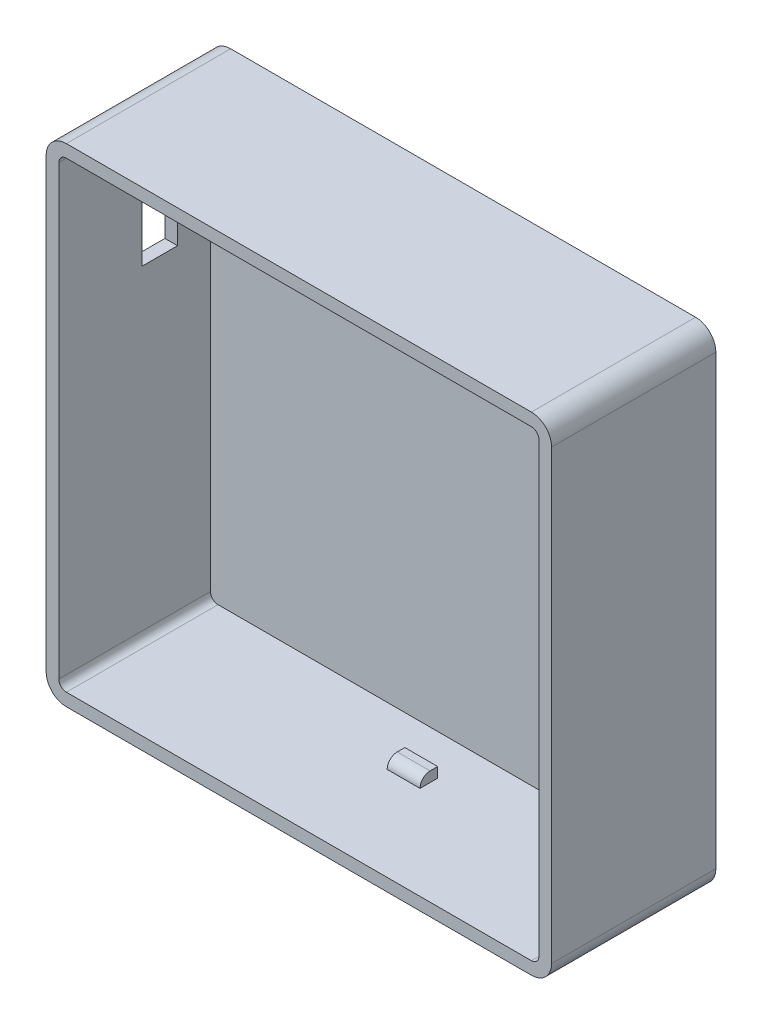
ISO-10303-21;
HEADER;
FILE_DESCRIPTION(('STEP AP214'),'2;1');
FILE_NAME('part.step','',(''),(''),'','','');
FILE_SCHEMA(('AUTOMOTIVE_DESIGN { 1 0 10303 214 1 1 1 1 }'));
ENDSEC;
DATA;
#1=APPLICATION_CONTEXT('core data for automotive mechanical design processes');
#2=APPLICATION_PROTOCOL_DEFINITION('international standard','automotive_design',2000,#1);
#3=PRODUCT_CONTEXT('',#1,'mechanical');
#4=PRODUCT('Part','Part','',(#3));
#5=PRODUCT_RELATED_PRODUCT_CATEGORY('part','',(#4));
#6=PRODUCT_DEFINITION_FORMATION('','',#4);
#7=PRODUCT_DEFINITION_CONTEXT('part definition',#1,'design');
#8=PRODUCT_DEFINITION('design','',#6,#7);
#9=PRODUCT_DEFINITION_SHAPE('','',#8);
#10=(LENGTH_UNIT() NAMED_UNIT(*) SI_UNIT(.MILLI.,.METRE.));
#11=(NAMED_UNIT(*) PLANE_ANGLE_UNIT() SI_UNIT($,.RADIAN.));
#12=(NAMED_UNIT(*) SI_UNIT($,.STERADIAN.) SOLID_ANGLE_UNIT());
#13=UNCERTAINTY_MEASURE_WITH_UNIT(LENGTH_MEASURE(1.E-05),#10,'distance_accuracy_value','');
#14=(GEOMETRIC_REPRESENTATION_CONTEXT(3) GLOBAL_UNCERTAINTY_ASSIGNED_CONTEXT((#13)) GLOBAL_UNIT_ASSIGNED_CONTEXT((#10,
#11,#12)) REPRESENTATION_CONTEXT('',''));
#15=CARTESIAN_POINT('',(0.,0.,0.));
#16=DIRECTION('',(0.,0.,1.));
#17=DIRECTION('',(1.,0.,0.));
#18=AXIS2_PLACEMENT_3D('',#15,#16,#17);
#19=CARTESIAN_POINT('',(0.,1.27,6.096));
#20=DIRECTION('',(-1.,0.,0.));
#21=DIRECTION('',(0.,0.,1.));
#22=AXIS2_PLACEMENT_3D('',#19,#20,#21);
#23=CYLINDRICAL_SURFACE('',#22,1.016);
#24=DIRECTION('',(1.,0.,0.));
#25=VECTOR('',#24,1.);
#26=CARTESIAN_POINT('',(0.,2.286,6.096));
#27=LINE('',#26,#25);
#28=CARTESIAN_POINT('',(24.8753946937101,2.286,6.096));
#29=VERTEX_POINT('',#28);
#30=CARTESIAN_POINT('',(28.1773946937101,2.286,6.096));
#31=VERTEX_POINT('',#30);
#32=EDGE_CURVE('E488',#29,#31,#27,.T.);
#33=ORIENTED_EDGE('',*,*,#32,.F.);
#34=CARTESIAN_POINT('',(24.8753946937101,1.27,6.096));
#35=DIRECTION('',(-1.,0.,0.));
#36=DIRECTION('',(0.,0.,1.));
#37=AXIS2_PLACEMENT_3D('',#34,#35,#36);
#38=CIRCLE('',#37,1.016);
#39=CARTESIAN_POINT('',(24.8753946937101,1.27,7.112));
#40=VERTEX_POINT('',#39);
#41=EDGE_CURVE('E40',#40,#29,#38,.T.);
#42=ORIENTED_EDGE('',*,*,#41,.F.);
#43=DIRECTION('',(1.,0.,0.));
#44=VECTOR('',#43,1.);
#45=CARTESIAN_POINT('',(0.,1.27,7.112));
#46=LINE('',#45,#44);
#47=CARTESIAN_POINT('',(28.1773946937101,1.27,7.112));
#48=VERTEX_POINT('',#47);
#49=EDGE_CURVE('E484',#40,#48,#46,.T.);
#50=ORIENTED_EDGE('',*,*,#49,.T.);
#51=CARTESIAN_POINT('',(28.1773946937101,1.27,6.096));
#52=DIRECTION('',(1.,0.,0.));
#53=DIRECTION('',(0.,0.,-1.));
#54=AXIS2_PLACEMENT_3D('',#51,#52,#53);
#55=CIRCLE('',#54,1.016);
#56=EDGE_CURVE('E11',#31,#48,#55,.T.);
#57=ORIENTED_EDGE('',*,*,#56,.F.);
#58=EDGE_LOOP('',(#33,#42,#50,#57));
#59=FACE_BOUND('',#58,.T.);
#60=ADVANCED_FACE('F33',(#59),#23,.T.);
#61=CARTESIAN_POINT('',(49.53,0.,6.096));
#62=DIRECTION('',(0.,-1.,0.));
#63=DIRECTION('',(0.,0.,-1.));
#64=AXIS2_PLACEMENT_3D('',#61,#62,#63);
#65=CYLINDRICAL_SURFACE('',#64,1.016);
#66=DIRECTION('',(0.,1.,0.));
#67=VECTOR('',#66,1.);
#68=CARTESIAN_POINT('',(48.514,0.,6.096));
#69=LINE('',#68,#67);
#70=CARTESIAN_POINT('',(48.514,24.3622601140778,6.096));
#71=VERTEX_POINT('',#70);
#72=CARTESIAN_POINT('',(48.514,27.6642601140778,6.096));
#73=VERTEX_POINT('',#72);
#74=EDGE_CURVE('E473',#71,#73,#69,.T.);
#75=ORIENTED_EDGE('',*,*,#74,.F.);
#76=CARTESIAN_POINT('',(49.53,24.3622601140778,6.096));
#77=DIRECTION('',(0.,-1.,0.));
#78=DIRECTION('',(0.,0.,-1.));
#79=AXIS2_PLACEMENT_3D('',#76,#77,#78);
#80=CIRCLE('',#79,1.016);
#81=CARTESIAN_POINT('',(49.53,24.3622601140778,7.112));
#82=VERTEX_POINT('',#81);
#83=EDGE_CURVE('E476',#82,#71,#80,.T.);
#84=ORIENTED_EDGE('',*,*,#83,.F.);
#85=DIRECTION('',(0.,1.,0.));
#86=VECTOR('',#85,1.);
#87=CARTESIAN_POINT('',(49.53,0.,7.112));
#88=LINE('',#87,#86);
#89=CARTESIAN_POINT('',(49.53,27.6642601140778,7.112));
#90=VERTEX_POINT('',#89);
#91=EDGE_CURVE('E470',#82,#90,#88,.T.);
#92=ORIENTED_EDGE('',*,*,#91,.T.);
#93=CARTESIAN_POINT('',(49.53,27.6642601140778,6.096));
#94=DIRECTION('',(0.,1.,0.));
#95=DIRECTION('',(0.,0.,1.));
#96=AXIS2_PLACEMENT_3D('',#93,#94,#95);
#97=CIRCLE('',#96,1.016);
#98=EDGE_CURVE('E478',#73,#90,#97,.T.);
#99=ORIENTED_EDGE('',*,*,#98,.F.);
#100=EDGE_LOOP('',(#75,#84,#92,#99));
#101=FACE_BOUND('',#100,.T.);
#102=ADVANCED_FACE('F497',(#101),#65,.T.);
#103=CARTESIAN_POINT('',(0.,47.752,6.22145987488172));
#104=DIRECTION('',(1.,0.,0.));
#105=DIRECTION('',(0.,0.,-1.));
#106=AXIS2_PLACEMENT_3D('',#103,#104,#105);
#107=CYLINDRICAL_SURFACE('',#106,1.016);
#108=DIRECTION('',(-1.,0.,0.));
#109=VECTOR('',#108,1.);
#110=CARTESIAN_POINT('',(0.,46.736,6.22145987488172));
#111=LINE('',#110,#109);
#112=CARTESIAN_POINT('',(24.721553607334,46.736,6.22145987488172));
#113=VERTEX_POINT('',#112);
#114=CARTESIAN_POINT('',(21.469490007334,46.736,6.22145987488172));
#115=VERTEX_POINT('',#114);
#116=EDGE_CURVE('E454',#113,#115,#111,.T.);
#117=ORIENTED_EDGE('',*,*,#116,.F.);
#118=CARTESIAN_POINT('',(24.721553607334,47.752,6.22145987488172));
#119=DIRECTION('',(1.,0.,0.));
#120=DIRECTION('',(0.,0.,-1.));
#121=AXIS2_PLACEMENT_3D('',#118,#119,#120);
#122=CIRCLE('',#121,1.016);
#123=CARTESIAN_POINT('',(24.721553607334,47.752,7.23745987488172));
#124=VERTEX_POINT('',#123);
#125=EDGE_CURVE('E457',#124,#113,#122,.T.);
#126=ORIENTED_EDGE('',*,*,#125,.F.);
#127=DIRECTION('',(1.,0.,0.));
#128=VECTOR('',#127,1.);
#129=CARTESIAN_POINT('',(0.,47.752,7.23745987488172));
#130=LINE('',#129,#128);
#131=CARTESIAN_POINT('',(21.469490007334,47.752,7.23745987488172));
#132=VERTEX_POINT('',#131);
#133=EDGE_CURVE('E442',#132,#124,#130,.T.);
#134=ORIENTED_EDGE('',*,*,#133,.F.);
#135=CARTESIAN_POINT('',(21.469490007334,47.752,6.22145987488172));
#136=DIRECTION('',(-1.,0.,0.));
#137=DIRECTION('',(0.,0.,1.));
#138=AXIS2_PLACEMENT_3D('',#135,#136,#137);
#139=CIRCLE('',#138,1.016);
#140=EDGE_CURVE('E459',#115,#132,#139,.T.);
#141=ORIENTED_EDGE('',*,*,#140,.F.);
#142=EDGE_LOOP('',(#117,#126,#134,#141));
#143=FACE_BOUND('',#142,.T.);
#144=ADVANCED_FACE('F501',(#143),#107,.T.);
#145=CARTESIAN_POINT('',(0.,0.,16.51));
#146=DIRECTION('',(-1.,0.,0.));
#147=DIRECTION('',(0.,0.,1.));
#148=AXIS2_PLACEMENT_3D('',#145,#146,#147);
#149=PLANE('',#148);
#150=DIRECTION('',(0.,1.,0.));
#151=VECTOR('',#150,1.);
#152=CARTESIAN_POINT('',(0.,43.942,8.128));
#153=LINE('',#152,#151);
#154=CARTESIAN_POINT('',(0.,33.782,8.128));
#155=VERTEX_POINT('',#154);
#156=CARTESIAN_POINT('',(0.,43.942,8.128));
#157=VERTEX_POINT('',#156);
#158=EDGE_CURVE('E287',#155,#157,#153,.T.);
#159=ORIENTED_EDGE('',*,*,#158,.F.);
#160=DIRECTION('',(0.,0.,1.));
#161=VECTOR('',#160,1.);
#162=CARTESIAN_POINT('',(0.,33.782,8.128));
#163=LINE('',#162,#161);
#164=CARTESIAN_POINT('',(0.,33.782,4.572));
#165=VERTEX_POINT('',#164);
#166=EDGE_CURVE('E294',#165,#155,#163,.T.);
#167=ORIENTED_EDGE('',*,*,#166,.F.);
#168=DIRECTION('',(0.,-1.,0.));
#169=VECTOR('',#168,1.);
#170=CARTESIAN_POINT('',(0.,43.942,4.572));
#171=LINE('',#170,#169);
#172=CARTESIAN_POINT('',(0.,43.942,4.572));
#173=VERTEX_POINT('',#172);
#174=EDGE_CURVE('E308',#173,#165,#171,.T.);
#175=ORIENTED_EDGE('',*,*,#174,.F.);
#176=DIRECTION('',(0.,0.,-1.));
#177=VECTOR('',#176,1.);
#178=CARTESIAN_POINT('',(0.,43.942,8.128));
#179=LINE('',#178,#177);
#180=EDGE_CURVE('E305',#157,#173,#179,.T.);
#181=ORIENTED_EDGE('',*,*,#180,.F.);
#182=EDGE_LOOP('',(#159,#167,#175,#181));
#183=FACE_BOUND('',#182,.T.);
#184=DIRECTION('',(0.,1.,0.));
#185=VECTOR('',#184,1.);
#186=CARTESIAN_POINT('',(0.,0.,0.));
#187=LINE('',#186,#185);
#188=CARTESIAN_POINT('',(0.,2.032,0.));
#189=VERTEX_POINT('',#188);
#190=CARTESIAN_POINT('',(0.,46.99,0.));
#191=VERTEX_POINT('',#190);
#192=EDGE_CURVE('E328',#189,#191,#187,.T.);
#193=ORIENTED_EDGE('',*,*,#192,.F.);
#194=DIRECTION('',(0.,0.,-1.));
#195=VECTOR('',#194,1.);
#196=CARTESIAN_POINT('',(0.,2.032,16.51));
#197=LINE('',#196,#195);
#198=CARTESIAN_POINT('',(0.,2.032,16.51));
#199=VERTEX_POINT('',#198);
#200=EDGE_CURVE('E440',#189,#199,#197,.F.);
#201=ORIENTED_EDGE('',*,*,#200,.T.);
#202=DIRECTION('',(0.,1.,0.));
#203=VECTOR('',#202,1.);
#204=CARTESIAN_POINT('',(0.,0.,16.51));
#205=LINE('',#204,#203);
#206=CARTESIAN_POINT('',(0.,46.99,16.51));
#207=VERTEX_POINT('',#206);
#208=EDGE_CURVE('E383',#199,#207,#205,.T.);
#209=ORIENTED_EDGE('',*,*,#208,.T.);
#210=DIRECTION('',(0.,0.,-1.));
#211=VECTOR('',#210,1.);
#212=CARTESIAN_POINT('',(0.,46.99,16.51));
#213=LINE('',#212,#211);
#214=EDGE_CURVE('E437',#207,#191,#213,.T.);
#215=ORIENTED_EDGE('',*,*,#214,.T.);
#216=EDGE_LOOP('',(#193,#201,#209,#215));
#217=FACE_BOUND('',#216,.T.);
#218=ADVANCED_FACE('F506',(#183,#217),#149,.T.);
#219=CARTESIAN_POINT('',(0.,0.,16.51));
#220=DIRECTION('',(0.,1.,0.));
#221=DIRECTION('',(0.,0.,1.));
#222=AXIS2_PLACEMENT_3D('',#219,#220,#221);
#223=PLANE('',#222);
#224=DIRECTION('',(1.,0.,0.));
#225=VECTOR('',#224,1.);
#226=CARTESIAN_POINT('',(0.,0.,0.));
#227=LINE('',#226,#225);
#228=CARTESIAN_POINT('',(2.032,0.,0.));
#229=VERTEX_POINT('',#228);
#230=CARTESIAN_POINT('',(48.768,0.,0.));
#231=VERTEX_POINT('',#230);
#232=EDGE_CURVE('E387',#229,#231,#227,.T.);
#233=ORIENTED_EDGE('',*,*,#232,.T.);
#234=DIRECTION('',(0.,0.,-1.));
#235=VECTOR('',#234,1.);
#236=CARTESIAN_POINT('',(48.768,0.,16.51));
#237=LINE('',#236,#235);
#238=CARTESIAN_POINT('',(48.768,0.,16.51));
#239=VERTEX_POINT('',#238);
#240=EDGE_CURVE('E422',#231,#239,#237,.F.);
#241=ORIENTED_EDGE('',*,*,#240,.T.);
#242=DIRECTION('',(1.,0.,0.));
#243=VECTOR('',#242,1.);
#244=CARTESIAN_POINT('',(0.,0.,16.51));
#245=LINE('',#244,#243);
#246=CARTESIAN_POINT('',(2.032,0.,16.51));
#247=VERTEX_POINT('',#246);
#248=EDGE_CURVE('E393',#247,#239,#245,.T.);
#249=ORIENTED_EDGE('',*,*,#248,.F.);
#250=DIRECTION('',(0.,0.,-1.));
#251=VECTOR('',#250,1.);
#252=CARTESIAN_POINT('',(2.032,0.,0.));
#253=LINE('',#252,#251);
#254=EDGE_CURVE('E419',#247,#229,#253,.T.);
#255=ORIENTED_EDGE('',*,*,#254,.T.);
#256=EDGE_LOOP('',(#233,#241,#249,#255));
#257=FACE_BOUND('',#256,.T.);
#258=ADVANCED_FACE('F531',(#257),#223,.F.);
#259=CARTESIAN_POINT('',(50.8,0.,16.51));
#260=DIRECTION('',(-1.,0.,0.));
#261=DIRECTION('',(0.,0.,1.));
#262=AXIS2_PLACEMENT_3D('',#259,#260,#261);
#263=PLANE('',#262);
#264=DIRECTION('',(0.,1.,0.));
#265=VECTOR('',#264,1.);
#266=CARTESIAN_POINT('',(50.8,0.,16.51));
#267=LINE('',#266,#265);
#268=CARTESIAN_POINT('',(50.8,2.032,16.51));
#269=VERTEX_POINT('',#268);
#270=CARTESIAN_POINT('',(50.8,46.99,16.51));
#271=VERTEX_POINT('',#270);
#272=EDGE_CURVE('E390',#269,#271,#267,.T.);
#273=ORIENTED_EDGE('',*,*,#272,.F.);
#274=DIRECTION('',(0.,0.,-1.));
#275=VECTOR('',#274,1.);
#276=CARTESIAN_POINT('',(50.8,2.032,16.51));
#277=LINE('',#276,#275);
#278=CARTESIAN_POINT('',(50.8,2.032,0.));
#279=VERTEX_POINT('',#278);
#280=EDGE_CURVE('E408',#269,#279,#277,.T.);
#281=ORIENTED_EDGE('',*,*,#280,.T.);
#282=DIRECTION('',(0.,1.,0.));
#283=VECTOR('',#282,1.);
#284=CARTESIAN_POINT('',(50.8,0.,0.));
#285=LINE('',#284,#283);
#286=CARTESIAN_POINT('',(50.8,46.99,0.));
#287=VERTEX_POINT('',#286);
#288=EDGE_CURVE('E402',#279,#287,#285,.T.);
#289=ORIENTED_EDGE('',*,*,#288,.T.);
#290=DIRECTION('',(0.,0.,-1.));
#291=VECTOR('',#290,1.);
#292=CARTESIAN_POINT('',(50.8,46.99,16.51));
#293=LINE('',#292,#291);
#294=EDGE_CURVE('E396',#287,#271,#293,.F.);
#295=ORIENTED_EDGE('',*,*,#294,.T.);
#296=EDGE_LOOP('',(#273,#281,#289,#295));
#297=FACE_BOUND('',#296,.T.);
#298=ADVANCED_FACE('F537',(#297),#263,.F.);
#299=CARTESIAN_POINT('',(0.,49.022,16.51));
#300=DIRECTION('',(0.,1.,0.));
#301=DIRECTION('',(0.,0.,1.));
#302=AXIS2_PLACEMENT_3D('',#299,#300,#301);
#303=PLANE('',#302);
#304=DIRECTION('',(1.,0.,0.));
#305=VECTOR('',#304,1.);
#306=CARTESIAN_POINT('',(0.,49.022,16.51));
#307=LINE('',#306,#305);
#308=CARTESIAN_POINT('',(2.032,49.022,16.51));
#309=VERTEX_POINT('',#308);
#310=CARTESIAN_POINT('',(48.768,49.022,16.51));
#311=VERTEX_POINT('',#310);
#312=EDGE_CURVE('E386',#309,#311,#307,.T.);
#313=ORIENTED_EDGE('',*,*,#312,.T.);
#314=DIRECTION('',(0.,0.,-1.));
#315=VECTOR('',#314,1.);
#316=CARTESIAN_POINT('',(48.768,49.022,0.));
#317=LINE('',#316,#315);
#318=CARTESIAN_POINT('',(48.768,49.022,0.));
#319=VERTEX_POINT('',#318);
#320=EDGE_CURVE('E434',#311,#319,#317,.T.);
#321=ORIENTED_EDGE('',*,*,#320,.T.);
#322=DIRECTION('',(1.,0.,0.));
#323=VECTOR('',#322,1.);
#324=CARTESIAN_POINT('',(0.,49.022,0.));
#325=LINE('',#324,#323);
#326=CARTESIAN_POINT('',(2.032,49.022,0.));
#327=VERTEX_POINT('',#326);
#328=EDGE_CURVE('E399',#327,#319,#325,.T.);
#329=ORIENTED_EDGE('',*,*,#328,.F.);
#330=DIRECTION('',(0.,0.,-1.));
#331=VECTOR('',#330,1.);
#332=CARTESIAN_POINT('',(2.032,49.022,16.51));
#333=LINE('',#332,#331);
#334=EDGE_CURVE('E432',#327,#309,#333,.F.);
#335=ORIENTED_EDGE('',*,*,#334,.T.);
#336=EDGE_LOOP('',(#313,#321,#329,#335));
#337=FACE_BOUND('',#336,.T.);
#338=ADVANCED_FACE('F533',(#337),#303,.T.);
#339=CARTESIAN_POINT('',(0.,0.,16.51));
#340=DIRECTION('',(0.,0.,-1.));
#341=DIRECTION('',(-1.,0.,0.));
#342=AXIS2_PLACEMENT_3D('',#339,#340,#341);
#343=PLANE('',#342);
#344=DIRECTION('',(1.,0.,0.));
#345=VECTOR('',#344,1.);
#346=CARTESIAN_POINT('',(0.,1.27,16.51));
#347=LINE('',#346,#345);
#348=CARTESIAN_POINT('',(2.032,1.27,16.51));
#349=VERTEX_POINT('',#348);
#350=CARTESIAN_POINT('',(48.768,1.27,16.51));
#351=VERTEX_POINT('',#350);
#352=EDGE_CURVE('E361',#349,#351,#347,.T.);
#353=ORIENTED_EDGE('',*,*,#352,.F.);
#354=CARTESIAN_POINT('',(2.032,2.032,16.51));
#355=DIRECTION('',(0.,0.,-1.));
#356=DIRECTION('',(-1.,0.,0.));
#357=AXIS2_PLACEMENT_3D('',#354,#355,#356);
#358=CIRCLE('',#357,0.762);
#359=CARTESIAN_POINT('',(1.27,2.032,16.51));
#360=VERTEX_POINT('',#359);
#361=EDGE_CURVE('E370',#360,#349,#358,.F.);
#362=ORIENTED_EDGE('',*,*,#361,.F.);
#363=DIRECTION('',(0.,1.,0.));
#364=VECTOR('',#363,1.);
#365=CARTESIAN_POINT('',(1.27,0.,16.51));
#366=LINE('',#365,#364);
#367=CARTESIAN_POINT('',(1.27,46.99,16.51));
#368=VERTEX_POINT('',#367);
#369=EDGE_CURVE('E343',#360,#368,#366,.T.);
#370=ORIENTED_EDGE('',*,*,#369,.T.);
#371=CARTESIAN_POINT('',(2.032,46.99,16.51));
#372=DIRECTION('',(0.,0.,-1.));
#373=DIRECTION('',(-1.,0.,0.));
#374=AXIS2_PLACEMENT_3D('',#371,#372,#373);
#375=CIRCLE('',#374,0.762);
#376=CARTESIAN_POINT('',(2.032,47.752,16.51));
#377=VERTEX_POINT('',#376);
#378=EDGE_CURVE('E354',#377,#368,#375,.F.);
#379=ORIENTED_EDGE('',*,*,#378,.F.);
#380=DIRECTION('',(1.,0.,0.));
#381=VECTOR('',#380,1.);
#382=CARTESIAN_POINT('',(0.,47.752,16.51));
#383=LINE('',#382,#381);
#384=CARTESIAN_POINT('',(48.768,47.752,16.51));
#385=VERTEX_POINT('',#384);
#386=EDGE_CURVE('E369',#377,#385,#383,.T.);
#387=ORIENTED_EDGE('',*,*,#386,.T.);
#388=CARTESIAN_POINT('',(48.768,46.99,16.51));
#389=DIRECTION('',(0.,0.,-1.));
#390=DIRECTION('',(-1.,0.,0.));
#391=AXIS2_PLACEMENT_3D('',#388,#389,#390);
#392=CIRCLE('',#391,0.762);
#393=CARTESIAN_POINT('',(49.53,46.99,16.51));
#394=VERTEX_POINT('',#393);
#395=EDGE_CURVE('E372',#394,#385,#392,.F.);
#396=ORIENTED_EDGE('',*,*,#395,.F.);
#397=DIRECTION('',(0.,1.,0.));
#398=VECTOR('',#397,1.);
#399=CARTESIAN_POINT('',(49.53,0.,16.51));
#400=LINE('',#399,#398);
#401=CARTESIAN_POINT('',(49.53,2.032,16.51));
#402=VERTEX_POINT('',#401);
#403=EDGE_CURVE('E375',#402,#394,#400,.T.);
#404=ORIENTED_EDGE('',*,*,#403,.F.);
#405=CARTESIAN_POINT('',(48.768,2.032,16.51));
#406=DIRECTION('',(0.,0.,-1.));
#407=DIRECTION('',(-1.,0.,0.));
#408=AXIS2_PLACEMENT_3D('',#405,#406,#407);
#409=CIRCLE('',#408,0.762);
#410=EDGE_CURVE('E366',#351,#402,#409,.F.);
#411=ORIENTED_EDGE('',*,*,#410,.F.);
#412=EDGE_LOOP('',(#353,#362,#370,#379,#387,#396,#404,#411));
#413=FACE_BOUND('',#412,.T.);
#414=ORIENTED_EDGE('',*,*,#248,.T.);
#415=CARTESIAN_POINT('',(48.768,2.032,16.51));
#416=DIRECTION('',(0.,0.,-1.));
#417=DIRECTION('',(-1.,0.,0.));
#418=AXIS2_PLACEMENT_3D('',#415,#416,#417);
#419=CIRCLE('',#418,2.032);
#420=EDGE_CURVE('E430',#239,#269,#419,.F.);
#421=ORIENTED_EDGE('',*,*,#420,.T.);
#422=ORIENTED_EDGE('',*,*,#272,.T.);
#423=CARTESIAN_POINT('',(48.768,46.99,16.51));
#424=DIRECTION('',(0.,0.,-1.));
#425=DIRECTION('',(-1.,0.,0.));
#426=AXIS2_PLACEMENT_3D('',#423,#424,#425);
#427=CIRCLE('',#426,2.032);
#428=EDGE_CURVE('E428',#271,#311,#427,.F.);
#429=ORIENTED_EDGE('',*,*,#428,.T.);
#430=ORIENTED_EDGE('',*,*,#312,.F.);
#431=CARTESIAN_POINT('',(2.032,46.99,16.51));
#432=DIRECTION('',(0.,0.,-1.));
#433=DIRECTION('',(-1.,0.,0.));
#434=AXIS2_PLACEMENT_3D('',#431,#432,#433);
#435=CIRCLE('',#434,2.032);
#436=EDGE_CURVE('E424',#309,#207,#435,.F.);
#437=ORIENTED_EDGE('',*,*,#436,.T.);
#438=ORIENTED_EDGE('',*,*,#208,.F.);
#439=CARTESIAN_POINT('',(2.032,2.032,16.51));
#440=DIRECTION('',(0.,0.,-1.));
#441=DIRECTION('',(-1.,0.,0.));
#442=AXIS2_PLACEMENT_3D('',#439,#440,#441);
#443=CIRCLE('',#442,2.032);
#444=EDGE_CURVE('E426',#199,#247,#443,.F.);
#445=ORIENTED_EDGE('',*,*,#444,.T.);
#446=EDGE_LOOP('',(#414,#421,#422,#429,#430,#437,#438,#445));
#447=FACE_BOUND('',#446,.T.);
#448=ADVANCED_FACE('F536',(#413,#447),#343,.F.);
#449=CARTESIAN_POINT('',(0.,0.,0.));
#450=DIRECTION('',(0.,0.,-1.));
#451=DIRECTION('',(-1.,0.,0.));
#452=AXIS2_PLACEMENT_3D('',#449,#450,#451);
#453=PLANE('',#452);
#454=ORIENTED_EDGE('',*,*,#288,.F.);
#455=CARTESIAN_POINT('',(48.768,2.032,0.));
#456=DIRECTION('',(0.,0.,-1.));
#457=DIRECTION('',(-1.,0.,0.));
#458=AXIS2_PLACEMENT_3D('',#455,#456,#457);
#459=CIRCLE('',#458,2.032);
#460=EDGE_CURVE('E417',#279,#231,#459,.T.);
#461=ORIENTED_EDGE('',*,*,#460,.T.);
#462=ORIENTED_EDGE('',*,*,#232,.F.);
#463=CARTESIAN_POINT('',(2.032,2.032,0.));
#464=DIRECTION('',(0.,0.,-1.));
#465=DIRECTION('',(-1.,0.,0.));
#466=AXIS2_PLACEMENT_3D('',#463,#464,#465);
#467=CIRCLE('',#466,2.032);
#468=EDGE_CURVE('E413',#229,#189,#467,.T.);
#469=ORIENTED_EDGE('',*,*,#468,.T.);
#470=ORIENTED_EDGE('',*,*,#192,.T.);
#471=CARTESIAN_POINT('',(2.032,46.99,0.));
#472=DIRECTION('',(0.,0.,-1.));
#473=DIRECTION('',(-1.,0.,0.));
#474=AXIS2_PLACEMENT_3D('',#471,#472,#473);
#475=CIRCLE('',#474,2.032);
#476=EDGE_CURVE('E411',#191,#327,#475,.T.);
#477=ORIENTED_EDGE('',*,*,#476,.T.);
#478=ORIENTED_EDGE('',*,*,#328,.T.);
#479=CARTESIAN_POINT('',(48.768,46.99,0.));
#480=DIRECTION('',(0.,0.,-1.));
#481=DIRECTION('',(-1.,0.,0.));
#482=AXIS2_PLACEMENT_3D('',#479,#480,#481);
#483=CIRCLE('',#482,2.032);
#484=EDGE_CURVE('E415',#319,#287,#483,.T.);
#485=ORIENTED_EDGE('',*,*,#484,.T.);
#486=EDGE_LOOP('',(#454,#461,#462,#469,#470,#477,#478,#485));
#487=FACE_BOUND('',#486,.T.);
#488=ADVANCED_FACE('F527',(#487),#453,.T.);
#489=CARTESIAN_POINT('',(48.768,2.032,16.51));
#490=DIRECTION('',(0.,0.,-1.));
#491=DIRECTION('',(-1.,0.,0.));
#492=AXIS2_PLACEMENT_3D('',#489,#490,#491);
#493=CYLINDRICAL_SURFACE('',#492,2.032);
#494=ORIENTED_EDGE('',*,*,#420,.F.);
#495=ORIENTED_EDGE('',*,*,#240,.F.);
#496=ORIENTED_EDGE('',*,*,#460,.F.);
#497=ORIENTED_EDGE('',*,*,#280,.F.);
#498=EDGE_LOOP('',(#494,#495,#496,#497));
#499=FACE_BOUND('',#498,.T.);
#500=ADVANCED_FACE('F523',(#499),#493,.T.);
#501=CARTESIAN_POINT('',(48.768,46.99,16.51));
#502=DIRECTION('',(0.,0.,1.));
#503=DIRECTION('',(1.,0.,0.));
#504=AXIS2_PLACEMENT_3D('',#501,#502,#503);
#505=CYLINDRICAL_SURFACE('',#504,2.032);
#506=ORIENTED_EDGE('',*,*,#428,.F.);
#507=ORIENTED_EDGE('',*,*,#294,.F.);
#508=ORIENTED_EDGE('',*,*,#484,.F.);
#509=ORIENTED_EDGE('',*,*,#320,.F.);
#510=EDGE_LOOP('',(#506,#507,#508,#509));
#511=FACE_BOUND('',#510,.T.);
#512=ADVANCED_FACE('F519',(#511),#505,.T.);
#513=CARTESIAN_POINT('',(2.032,2.032,16.51));
#514=DIRECTION('',(0.,0.,1.));
#515=DIRECTION('',(1.,0.,0.));
#516=AXIS2_PLACEMENT_3D('',#513,#514,#515);
#517=CYLINDRICAL_SURFACE('',#516,2.032);
#518=ORIENTED_EDGE('',*,*,#444,.F.);
#519=ORIENTED_EDGE('',*,*,#200,.F.);
#520=ORIENTED_EDGE('',*,*,#468,.F.);
#521=ORIENTED_EDGE('',*,*,#254,.F.);
#522=EDGE_LOOP('',(#518,#519,#520,#521));
#523=FACE_BOUND('',#522,.T.);
#524=ADVANCED_FACE('F515',(#523),#517,.T.);
#525=CARTESIAN_POINT('',(2.032,46.99,16.51));
#526=DIRECTION('',(0.,0.,-1.));
#527=DIRECTION('',(-1.,0.,0.));
#528=AXIS2_PLACEMENT_3D('',#525,#526,#527);
#529=CYLINDRICAL_SURFACE('',#528,2.032);
#530=ORIENTED_EDGE('',*,*,#436,.F.);
#531=ORIENTED_EDGE('',*,*,#334,.F.);
#532=ORIENTED_EDGE('',*,*,#476,.F.);
#533=ORIENTED_EDGE('',*,*,#214,.F.);
#534=EDGE_LOOP('',(#530,#531,#532,#533));
#535=FACE_BOUND('',#534,.T.);
#536=ADVANCED_FACE('F511',(#535),#529,.T.);
#537=CARTESIAN_POINT('',(1.27,0.,16.51));
#538=DIRECTION('',(-1.,0.,0.));
#539=DIRECTION('',(0.,0.,1.));
#540=AXIS2_PLACEMENT_3D('',#537,#538,#539);
#541=PLANE('',#540);
#542=DIRECTION('',(0.,0.,1.));
#543=VECTOR('',#542,1.);
#544=CARTESIAN_POINT('',(1.27,33.782,8.128));
#545=LINE('',#544,#543);
#546=CARTESIAN_POINT('',(1.27,33.782,4.572));
#547=VERTEX_POINT('',#546);
#548=CARTESIAN_POINT('',(1.27,33.782,8.128));
#549=VERTEX_POINT('',#548);
#550=EDGE_CURVE('E300',#547,#549,#545,.T.);
#551=ORIENTED_EDGE('',*,*,#550,.T.);
#552=DIRECTION('',(0.,1.,0.));
#553=VECTOR('',#552,1.);
#554=CARTESIAN_POINT('',(1.27,43.942,8.128));
#555=LINE('',#554,#553);
#556=CARTESIAN_POINT('',(1.27,43.942,8.128));
#557=VERTEX_POINT('',#556);
#558=EDGE_CURVE('E290',#549,#557,#555,.T.);
#559=ORIENTED_EDGE('',*,*,#558,.T.);
#560=DIRECTION('',(0.,0.,-1.));
#561=VECTOR('',#560,1.);
#562=CARTESIAN_POINT('',(1.27,43.942,8.128));
#563=LINE('',#562,#561);
#564=CARTESIAN_POINT('',(1.27,43.942,4.572));
#565=VERTEX_POINT('',#564);
#566=EDGE_CURVE('E293',#557,#565,#563,.T.);
#567=ORIENTED_EDGE('',*,*,#566,.T.);
#568=DIRECTION('',(0.,-1.,0.));
#569=VECTOR('',#568,1.);
#570=CARTESIAN_POINT('',(1.27,43.942,4.572));
#571=LINE('',#570,#569);
#572=EDGE_CURVE('E297',#565,#547,#571,.T.);
#573=ORIENTED_EDGE('',*,*,#572,.T.);
#574=EDGE_LOOP('',(#551,#559,#567,#573));
#575=FACE_BOUND('',#574,.T.);
#576=DIRECTION('',(0.,1.,0.));
#577=VECTOR('',#576,1.);
#578=CARTESIAN_POINT('',(1.27,0.,1.27));
#579=LINE('',#578,#577);
#580=CARTESIAN_POINT('',(1.27,2.032,1.27));
#581=VERTEX_POINT('',#580);
#582=CARTESIAN_POINT('',(1.27,46.99,1.27));
#583=VERTEX_POINT('',#582);
#584=EDGE_CURVE('E315',#581,#583,#579,.T.);
#585=ORIENTED_EDGE('',*,*,#584,.T.);
#586=DIRECTION('',(0.,0.,1.));
#587=VECTOR('',#586,1.);
#588=CARTESIAN_POINT('',(1.27,46.99,16.51));
#589=LINE('',#588,#587);
#590=EDGE_CURVE('E329',#368,#583,#589,.F.);
#591=ORIENTED_EDGE('',*,*,#590,.F.);
#592=ORIENTED_EDGE('',*,*,#369,.F.);
#593=DIRECTION('',(0.,0.,1.));
#594=VECTOR('',#593,1.);
#595=CARTESIAN_POINT('',(1.27,2.032,16.51));
#596=LINE('',#595,#594);
#597=EDGE_CURVE('E325',#581,#360,#596,.T.);
#598=ORIENTED_EDGE('',*,*,#597,.F.);
#599=EDGE_LOOP('',(#585,#591,#592,#598));
#600=FACE_BOUND('',#599,.T.);
#601=ADVANCED_FACE('F514',(#575,#600),#541,.F.);
#602=CARTESIAN_POINT('',(0.,1.27,16.51));
#603=DIRECTION('',(0.,1.,0.));
#604=DIRECTION('',(0.,0.,1.));
#605=AXIS2_PLACEMENT_3D('',#602,#603,#604);
#606=PLANE('',#605);
#607=DIRECTION('',(0.,0.,1.));
#608=VECTOR('',#607,1.);
#609=CARTESIAN_POINT('',(24.8753946937101,1.27,16.51));
#610=LINE('',#609,#608);
#611=CARTESIAN_POINT('',(24.8753946937101,1.27,5.334));
#612=VERTEX_POINT('',#611);
#613=EDGE_CURVE('E486',#612,#40,#610,.T.);
#614=ORIENTED_EDGE('',*,*,#613,.F.);
#615=DIRECTION('',(-1.,0.,0.));
#616=VECTOR('',#615,1.);
#617=CARTESIAN_POINT('',(0.,1.27,5.334));
#618=LINE('',#617,#616);
#619=CARTESIAN_POINT('',(28.1773946937101,1.27,5.334));
#620=VERTEX_POINT('',#619);
#621=EDGE_CURVE('E250',#620,#612,#618,.T.);
#622=ORIENTED_EDGE('',*,*,#621,.F.);
#623=DIRECTION('',(0.,0.,-1.));
#624=VECTOR('',#623,1.);
#625=CARTESIAN_POINT('',(28.1773946937101,1.27,16.51));
#626=LINE('',#625,#624);
#627=EDGE_CURVE('E481',#48,#620,#626,.T.);
#628=ORIENTED_EDGE('',*,*,#627,.F.);
#629=ORIENTED_EDGE('',*,*,#49,.F.);
#630=EDGE_LOOP('',(#614,#622,#628,#629));
#631=FACE_BOUND('',#630,.T.);
#632=DIRECTION('',(1.,0.,0.));
#633=VECTOR('',#632,1.);
#634=CARTESIAN_POINT('',(0.,1.27,1.27));
#635=LINE('',#634,#633);
#636=CARTESIAN_POINT('',(2.032,1.27,1.27));
#637=VERTEX_POINT('',#636);
#638=CARTESIAN_POINT('',(48.768,1.27,1.27));
#639=VERTEX_POINT('',#638);
#640=EDGE_CURVE('E336',#637,#639,#635,.T.);
#641=ORIENTED_EDGE('',*,*,#640,.F.);
#642=DIRECTION('',(0.,0.,1.));
#643=VECTOR('',#642,1.);
#644=CARTESIAN_POINT('',(2.032,1.27,16.51));
#645=LINE('',#644,#643);
#646=EDGE_CURVE('E339',#349,#637,#645,.F.);
#647=ORIENTED_EDGE('',*,*,#646,.F.);
#648=ORIENTED_EDGE('',*,*,#352,.T.);
#649=DIRECTION('',(0.,0.,1.));
#650=VECTOR('',#649,1.);
#651=CARTESIAN_POINT('',(48.768,1.27,16.51));
#652=LINE('',#651,#650);
#653=EDGE_CURVE('E352',#639,#351,#652,.T.);
#654=ORIENTED_EDGE('',*,*,#653,.F.);
#655=EDGE_LOOP('',(#641,#647,#648,#654));
#656=FACE_BOUND('',#655,.T.);
#657=ADVANCED_FACE('F494',(#631,#656),#606,.T.);
#658=CARTESIAN_POINT('',(49.53,0.,16.51));
#659=DIRECTION('',(-1.,0.,0.));
#660=DIRECTION('',(0.,0.,1.));
#661=AXIS2_PLACEMENT_3D('',#658,#659,#660);
#662=PLANE('',#661);
#663=ORIENTED_EDGE('',*,*,#91,.F.);
#664=DIRECTION('',(0.,0.,1.));
#665=VECTOR('',#664,1.);
#666=CARTESIAN_POINT('',(49.53,24.3622601140778,16.51));
#667=LINE('',#666,#665);
#668=CARTESIAN_POINT('',(49.53,24.3622601140778,5.334));
#669=VERTEX_POINT('',#668);
#670=EDGE_CURVE('E461',#669,#82,#667,.T.);
#671=ORIENTED_EDGE('',*,*,#670,.F.);
#672=DIRECTION('',(0.,-1.,0.));
#673=VECTOR('',#672,1.);
#674=CARTESIAN_POINT('',(49.53,0.,5.33399999999999));
#675=LINE('',#674,#673);
#676=CARTESIAN_POINT('',(49.53,27.6642601140778,5.334));
#677=VERTEX_POINT('',#676);
#678=EDGE_CURVE('E464',#677,#669,#675,.T.);
#679=ORIENTED_EDGE('',*,*,#678,.F.);
#680=DIRECTION('',(0.,0.,-1.));
#681=VECTOR('',#680,1.);
#682=CARTESIAN_POINT('',(49.53,27.6642601140778,16.5099999999999));
#683=LINE('',#682,#681);
#684=EDGE_CURVE('E467',#90,#677,#683,.T.);
#685=ORIENTED_EDGE('',*,*,#684,.F.);
#686=EDGE_LOOP('',(#663,#671,#679,#685));
#687=FACE_BOUND('',#686,.T.);
#688=ORIENTED_EDGE('',*,*,#403,.T.);
#689=DIRECTION('',(0.,0.,1.));
#690=VECTOR('',#689,1.);
#691=CARTESIAN_POINT('',(49.53,46.99,16.51));
#692=LINE('',#691,#690);
#693=CARTESIAN_POINT('',(49.53,46.99,1.27));
#694=VERTEX_POINT('',#693);
#695=EDGE_CURVE('E359',#694,#394,#692,.T.);
#696=ORIENTED_EDGE('',*,*,#695,.F.);
#697=DIRECTION('',(0.,1.,0.));
#698=VECTOR('',#697,1.);
#699=CARTESIAN_POINT('',(49.53,0.,1.27));
#700=LINE('',#699,#698);
#701=CARTESIAN_POINT('',(49.53,2.032,1.27));
#702=VERTEX_POINT('',#701);
#703=EDGE_CURVE('E333',#702,#694,#700,.T.);
#704=ORIENTED_EDGE('',*,*,#703,.F.);
#705=DIRECTION('',(0.,0.,1.));
#706=VECTOR('',#705,1.);
#707=CARTESIAN_POINT('',(49.53,2.032,16.51));
#708=LINE('',#707,#706);
#709=EDGE_CURVE('E348',#402,#702,#708,.F.);
#710=ORIENTED_EDGE('',*,*,#709,.F.);
#711=EDGE_LOOP('',(#688,#696,#704,#710));
#712=FACE_BOUND('',#711,.T.);
#713=ADVANCED_FACE('F575',(#687,#712),#662,.T.);
#714=CARTESIAN_POINT('',(0.,47.752,16.51));
#715=DIRECTION('',(0.,1.,0.));
#716=DIRECTION('',(0.,0.,1.));
#717=AXIS2_PLACEMENT_3D('',#714,#715,#716);
#718=PLANE('',#717);
#719=DIRECTION('',(-1.,0.,0.));
#720=VECTOR('',#719,1.);
#721=CARTESIAN_POINT('',(0.,47.752,5.334));
#722=LINE('',#721,#720);
#723=CARTESIAN_POINT('',(24.721553607334,47.752,5.334));
#724=VERTEX_POINT('',#723);
#725=CARTESIAN_POINT('',(21.469490007334,47.752,5.334));
#726=VERTEX_POINT('',#725);
#727=EDGE_CURVE('E448',#724,#726,#722,.T.);
#728=ORIENTED_EDGE('',*,*,#727,.T.);
#729=DIRECTION('',(0.,0.,1.));
#730=VECTOR('',#729,1.);
#731=CARTESIAN_POINT('',(21.469490007334,47.752,16.51));
#732=LINE('',#731,#730);
#733=EDGE_CURVE('E451',#726,#132,#732,.T.);
#734=ORIENTED_EDGE('',*,*,#733,.T.);
#735=ORIENTED_EDGE('',*,*,#133,.T.);
#736=DIRECTION('',(0.,0.,-1.));
#737=VECTOR('',#736,1.);
#738=CARTESIAN_POINT('',(24.721553607334,47.752,16.51));
#739=LINE('',#738,#737);
#740=EDGE_CURVE('E445',#124,#724,#739,.T.);
#741=ORIENTED_EDGE('',*,*,#740,.T.);
#742=EDGE_LOOP('',(#728,#734,#735,#741));
#743=FACE_BOUND('',#742,.T.);
#744=ORIENTED_EDGE('',*,*,#386,.F.);
#745=DIRECTION('',(0.,0.,1.));
#746=VECTOR('',#745,1.);
#747=CARTESIAN_POINT('',(2.032,47.752,16.51));
#748=LINE('',#747,#746);
#749=CARTESIAN_POINT('',(2.032,47.752,1.27));
#750=VERTEX_POINT('',#749);
#751=EDGE_CURVE('E364',#750,#377,#748,.T.);
#752=ORIENTED_EDGE('',*,*,#751,.F.);
#753=DIRECTION('',(1.,0.,0.));
#754=VECTOR('',#753,1.);
#755=CARTESIAN_POINT('',(0.,47.752,1.27));
#756=LINE('',#755,#754);
#757=CARTESIAN_POINT('',(48.768,47.752,1.27));
#758=VERTEX_POINT('',#757);
#759=EDGE_CURVE('E324',#750,#758,#756,.T.);
#760=ORIENTED_EDGE('',*,*,#759,.T.);
#761=DIRECTION('',(0.,0.,1.));
#762=VECTOR('',#761,1.);
#763=CARTESIAN_POINT('',(48.768,47.752,16.51));
#764=LINE('',#763,#762);
#765=EDGE_CURVE('E332',#385,#758,#764,.F.);
#766=ORIENTED_EDGE('',*,*,#765,.F.);
#767=EDGE_LOOP('',(#744,#752,#760,#766));
#768=FACE_BOUND('',#767,.T.);
#769=ADVANCED_FACE('F571',(#743,#768),#718,.F.);
#770=CARTESIAN_POINT('',(0.,0.,1.27));
#771=DIRECTION('',(0.,0.,-1.));
#772=DIRECTION('',(-1.,0.,0.));
#773=AXIS2_PLACEMENT_3D('',#770,#771,#772);
#774=PLANE('',#773);
#775=ORIENTED_EDGE('',*,*,#703,.T.);
#776=CARTESIAN_POINT('',(48.768,46.99,1.27));
#777=DIRECTION('',(0.,0.,-1.));
#778=DIRECTION('',(-1.,0.,0.));
#779=AXIS2_PLACEMENT_3D('',#776,#777,#778);
#780=CIRCLE('',#779,0.762);
#781=EDGE_CURVE('E340',#758,#694,#780,.T.);
#782=ORIENTED_EDGE('',*,*,#781,.F.);
#783=ORIENTED_EDGE('',*,*,#759,.F.);
#784=CARTESIAN_POINT('',(2.032,46.99,1.27));
#785=DIRECTION('',(0.,0.,-1.));
#786=DIRECTION('',(-1.,0.,0.));
#787=AXIS2_PLACEMENT_3D('',#784,#785,#786);
#788=CIRCLE('',#787,0.762);
#789=EDGE_CURVE('E346',#583,#750,#788,.T.);
#790=ORIENTED_EDGE('',*,*,#789,.F.);
#791=ORIENTED_EDGE('',*,*,#584,.F.);
#792=CARTESIAN_POINT('',(2.032,2.032,1.27));
#793=DIRECTION('',(0.,0.,-1.));
#794=DIRECTION('',(-1.,0.,0.));
#795=AXIS2_PLACEMENT_3D('',#792,#793,#794);
#796=CIRCLE('',#795,0.762);
#797=EDGE_CURVE('E344',#637,#581,#796,.T.);
#798=ORIENTED_EDGE('',*,*,#797,.F.);
#799=ORIENTED_EDGE('',*,*,#640,.T.);
#800=CARTESIAN_POINT('',(48.768,2.032,1.27));
#801=DIRECTION('',(0.,0.,-1.));
#802=DIRECTION('',(-1.,0.,0.));
#803=AXIS2_PLACEMENT_3D('',#800,#801,#802);
#804=CIRCLE('',#803,0.762);
#805=EDGE_CURVE('E337',#702,#639,#804,.T.);
#806=ORIENTED_EDGE('',*,*,#805,.F.);
#807=EDGE_LOOP('',(#775,#782,#783,#790,#791,#798,#799,#806));
#808=FACE_BOUND('',#807,.T.);
#809=ADVANCED_FACE('F567',(#808),#774,.F.);
#810=CARTESIAN_POINT('',(48.768,2.032,16.51));
#811=DIRECTION('',(0.,0.,-1.));
#812=DIRECTION('',(-1.,0.,0.));
#813=AXIS2_PLACEMENT_3D('',#810,#811,#812);
#814=CYLINDRICAL_SURFACE('',#813,0.762);
#815=ORIENTED_EDGE('',*,*,#410,.T.);
#816=ORIENTED_EDGE('',*,*,#709,.T.);
#817=ORIENTED_EDGE('',*,*,#805,.T.);
#818=ORIENTED_EDGE('',*,*,#653,.T.);
#819=EDGE_LOOP('',(#815,#816,#817,#818));
#820=FACE_BOUND('',#819,.T.);
#821=ADVANCED_FACE('F563',(#820),#814,.F.);
#822=CARTESIAN_POINT('',(48.768,46.99,16.51));
#823=DIRECTION('',(0.,0.,1.));
#824=DIRECTION('',(1.,0.,0.));
#825=AXIS2_PLACEMENT_3D('',#822,#823,#824);
#826=CYLINDRICAL_SURFACE('',#825,0.762);
#827=ORIENTED_EDGE('',*,*,#395,.T.);
#828=ORIENTED_EDGE('',*,*,#765,.T.);
#829=ORIENTED_EDGE('',*,*,#781,.T.);
#830=ORIENTED_EDGE('',*,*,#695,.T.);
#831=EDGE_LOOP('',(#827,#828,#829,#830));
#832=FACE_BOUND('',#831,.T.);
#833=ADVANCED_FACE('F559',(#832),#826,.F.);
#834=CARTESIAN_POINT('',(2.032,2.032,16.51));
#835=DIRECTION('',(0.,0.,1.));
#836=DIRECTION('',(1.,0.,0.));
#837=AXIS2_PLACEMENT_3D('',#834,#835,#836);
#838=CYLINDRICAL_SURFACE('',#837,0.762);
#839=ORIENTED_EDGE('',*,*,#361,.T.);
#840=ORIENTED_EDGE('',*,*,#646,.T.);
#841=ORIENTED_EDGE('',*,*,#797,.T.);
#842=ORIENTED_EDGE('',*,*,#597,.T.);
#843=EDGE_LOOP('',(#839,#840,#841,#842));
#844=FACE_BOUND('',#843,.T.);
#845=ADVANCED_FACE('F555',(#844),#838,.F.);
#846=CARTESIAN_POINT('',(2.032,46.99,16.51));
#847=DIRECTION('',(0.,0.,-1.));
#848=DIRECTION('',(-1.,0.,0.));
#849=AXIS2_PLACEMENT_3D('',#846,#847,#848);
#850=CYLINDRICAL_SURFACE('',#849,0.762);
#851=ORIENTED_EDGE('',*,*,#378,.T.);
#852=ORIENTED_EDGE('',*,*,#590,.T.);
#853=ORIENTED_EDGE('',*,*,#789,.T.);
#854=ORIENTED_EDGE('',*,*,#751,.T.);
#855=EDGE_LOOP('',(#851,#852,#853,#854));
#856=FACE_BOUND('',#855,.T.);
#857=ADVANCED_FACE('F551',(#856),#850,.F.);
#858=CARTESIAN_POINT('',(1.27,43.942,8.128));
#859=DIRECTION('',(0.,0.,1.));
#860=DIRECTION('',(1.,0.,0.));
#861=AXIS2_PLACEMENT_3D('',#858,#859,#860);
#862=PLANE('',#861);
#863=ORIENTED_EDGE('',*,*,#158,.T.);
#864=DIRECTION('',(-1.,0.,0.));
#865=VECTOR('',#864,1.);
#866=CARTESIAN_POINT('',(1.27,43.942,8.128));
#867=LINE('',#866,#865);
#868=EDGE_CURVE('E303',#557,#157,#867,.T.);
#869=ORIENTED_EDGE('',*,*,#868,.F.);
#870=ORIENTED_EDGE('',*,*,#558,.F.);
#871=DIRECTION('',(-1.,0.,0.));
#872=VECTOR('',#871,1.);
#873=CARTESIAN_POINT('',(1.27,33.782,8.128));
#874=LINE('',#873,#872);
#875=EDGE_CURVE('E313',#549,#155,#874,.T.);
#876=ORIENTED_EDGE('',*,*,#875,.T.);
#877=EDGE_LOOP('',(#863,#869,#870,#876));
#878=FACE_BOUND('',#877,.T.);
#879=ADVANCED_FACE('F554',(#878),#862,.F.);
#880=CARTESIAN_POINT('',(1.27,33.782,8.128));
#881=DIRECTION('',(0.,-1.,0.));
#882=DIRECTION('',(0.,0.,-1.));
#883=AXIS2_PLACEMENT_3D('',#880,#881,#882);
#884=PLANE('',#883);
#885=ORIENTED_EDGE('',*,*,#166,.T.);
#886=ORIENTED_EDGE('',*,*,#875,.F.);
#887=ORIENTED_EDGE('',*,*,#550,.F.);
#888=DIRECTION('',(-1.,0.,0.));
#889=VECTOR('',#888,1.);
#890=CARTESIAN_POINT('',(1.27,33.782,4.572));
#891=LINE('',#890,#889);
#892=EDGE_CURVE('E316',#547,#165,#891,.T.);
#893=ORIENTED_EDGE('',*,*,#892,.T.);
#894=EDGE_LOOP('',(#885,#886,#887,#893));
#895=FACE_BOUND('',#894,.T.);
#896=ADVANCED_FACE('F587',(#895),#884,.F.);
#897=CARTESIAN_POINT('',(1.27,43.942,4.572));
#898=DIRECTION('',(0.,0.,-1.));
#899=DIRECTION('',(0.,1.,0.));
#900=AXIS2_PLACEMENT_3D('',#897,#898,#899);
#901=PLANE('',#900);
#902=ORIENTED_EDGE('',*,*,#174,.T.);
#903=ORIENTED_EDGE('',*,*,#892,.F.);
#904=ORIENTED_EDGE('',*,*,#572,.F.);
#905=DIRECTION('',(-1.,0.,0.));
#906=VECTOR('',#905,1.);
#907=CARTESIAN_POINT('',(1.27,43.942,4.572));
#908=LINE('',#907,#906);
#909=EDGE_CURVE('E318',#565,#173,#908,.T.);
#910=ORIENTED_EDGE('',*,*,#909,.T.);
#911=EDGE_LOOP('',(#902,#903,#904,#910));
#912=FACE_BOUND('',#911,.T.);
#913=ADVANCED_FACE('F593',(#912),#901,.F.);
#914=CARTESIAN_POINT('',(1.27,43.942,8.128));
#915=DIRECTION('',(0.,1.,0.));
#916=DIRECTION('',(0.,0.,1.));
#917=AXIS2_PLACEMENT_3D('',#914,#915,#916);
#918=PLANE('',#917);
#919=ORIENTED_EDGE('',*,*,#180,.T.);
#920=ORIENTED_EDGE('',*,*,#909,.F.);
#921=ORIENTED_EDGE('',*,*,#566,.F.);
#922=ORIENTED_EDGE('',*,*,#868,.T.);
#923=EDGE_LOOP('',(#919,#920,#921,#922));
#924=FACE_BOUND('',#923,.T.);
#925=ADVANCED_FACE('F589',(#924),#918,.F.);
#926=CARTESIAN_POINT('',(21.469490007334,46.736,5.334));
#927=DIRECTION('',(-1.,0.,0.));
#928=DIRECTION('',(0.,0.,1.));
#929=AXIS2_PLACEMENT_3D('',#926,#927,#928);
#930=PLANE('',#929);
#931=DIRECTION('',(0.,0.,1.));
#932=VECTOR('',#931,1.);
#933=CARTESIAN_POINT('',(21.469490007334,46.736,5.334));
#934=LINE('',#933,#932);
#935=CARTESIAN_POINT('',(21.469490007334,46.736,5.334));
#936=VERTEX_POINT('',#935);
#937=EDGE_CURVE('E273',#936,#115,#934,.T.);
#938=ORIENTED_EDGE('',*,*,#937,.T.);
#939=ORIENTED_EDGE('',*,*,#140,.T.);
#940=ORIENTED_EDGE('',*,*,#733,.F.);
#941=DIRECTION('',(0.,1.,0.));
#942=VECTOR('',#941,1.);
#943=CARTESIAN_POINT('',(21.469490007334,46.736,5.334));
#944=LINE('',#943,#942);
#945=EDGE_CURVE('E284',#936,#726,#944,.T.);
#946=ORIENTED_EDGE('',*,*,#945,.F.);
#947=EDGE_LOOP('',(#938,#939,#940,#946));
#948=FACE_BOUND('',#947,.T.);
#949=ADVANCED_FACE('F592',(#948),#930,.T.);
#950=CARTESIAN_POINT('',(21.469490007334,46.736,5.334));
#951=DIRECTION('',(0.,0.,-1.));
#952=DIRECTION('',(-1.,0.,0.));
#953=AXIS2_PLACEMENT_3D('',#950,#951,#952);
#954=PLANE('',#953);
#955=ORIENTED_EDGE('',*,*,#727,.F.);
#956=DIRECTION('',(0.,1.,0.));
#957=VECTOR('',#956,1.);
#958=CARTESIAN_POINT('',(24.721553607334,46.736,5.334));
#959=LINE('',#958,#957);
#960=CARTESIAN_POINT('',(24.721553607334,46.736,5.334));
#961=VERTEX_POINT('',#960);
#962=EDGE_CURVE('E283',#961,#724,#959,.T.);
#963=ORIENTED_EDGE('',*,*,#962,.F.);
#964=DIRECTION('',(-1.,0.,0.));
#965=VECTOR('',#964,1.);
#966=CARTESIAN_POINT('',(21.469490007334,46.736,5.334));
#967=LINE('',#966,#965);
#968=EDGE_CURVE('E280',#961,#936,#967,.T.);
#969=ORIENTED_EDGE('',*,*,#968,.T.);
#970=ORIENTED_EDGE('',*,*,#945,.T.);
#971=EDGE_LOOP('',(#955,#963,#969,#970));
#972=FACE_BOUND('',#971,.T.);
#973=ADVANCED_FACE('F603',(#972),#954,.T.);
#974=CARTESIAN_POINT('',(24.721553607334,46.736,5.334));
#975=DIRECTION('',(1.,0.,0.));
#976=DIRECTION('',(0.,0.,-1.));
#977=AXIS2_PLACEMENT_3D('',#974,#975,#976);
#978=PLANE('',#977);
#979=ORIENTED_EDGE('',*,*,#740,.F.);
#980=ORIENTED_EDGE('',*,*,#125,.T.);
#981=DIRECTION('',(0.,0.,-1.));
#982=VECTOR('',#981,1.);
#983=CARTESIAN_POINT('',(24.721553607334,46.736,5.334));
#984=LINE('',#983,#982);
#985=EDGE_CURVE('E278',#113,#961,#984,.T.);
#986=ORIENTED_EDGE('',*,*,#985,.T.);
#987=ORIENTED_EDGE('',*,*,#962,.T.);
#988=EDGE_LOOP('',(#979,#980,#986,#987));
#989=FACE_BOUND('',#988,.T.);
#990=ADVANCED_FACE('F605',(#989),#978,.T.);
#991=CARTESIAN_POINT('',(0.,46.736,0.));
#992=DIRECTION('',(0.,1.,0.));
#993=DIRECTION('',(0.,0.,1.));
#994=AXIS2_PLACEMENT_3D('',#991,#992,#993);
#995=PLANE('',#994);
#996=ORIENTED_EDGE('',*,*,#985,.F.);
#997=ORIENTED_EDGE('',*,*,#116,.T.);
#998=ORIENTED_EDGE('',*,*,#937,.F.);
#999=ORIENTED_EDGE('',*,*,#968,.F.);
#1000=EDGE_LOOP('',(#996,#997,#998,#999));
#1001=FACE_BOUND('',#1000,.T.);
#1002=ADVANCED_FACE('F608',(#1001),#995,.F.);
#1003=CARTESIAN_POINT('',(48.514,27.6642601140778,7.112));
#1004=DIRECTION('',(0.,1.,0.));
#1005=DIRECTION('',(0.,0.,1.));
#1006=AXIS2_PLACEMENT_3D('',#1003,#1004,#1005);
#1007=PLANE('',#1006);
#1008=DIRECTION('',(0.,0.,1.));
#1009=VECTOR('',#1008,1.);
#1010=CARTESIAN_POINT('',(48.514,27.6642601140778,7.112));
#1011=LINE('',#1010,#1009);
#1012=CARTESIAN_POINT('',(48.514,27.6642601140778,5.334));
#1013=VERTEX_POINT('',#1012);
#1014=EDGE_CURVE('E266',#1013,#73,#1011,.T.);
#1015=ORIENTED_EDGE('',*,*,#1014,.T.);
#1016=ORIENTED_EDGE('',*,*,#98,.T.);
#1017=ORIENTED_EDGE('',*,*,#684,.T.);
#1018=DIRECTION('',(1.,0.,0.));
#1019=VECTOR('',#1018,1.);
#1020=CARTESIAN_POINT('',(48.514,27.6642601140778,5.334));
#1021=LINE('',#1020,#1019);
#1022=EDGE_CURVE('E270',#1013,#677,#1021,.T.);
#1023=ORIENTED_EDGE('',*,*,#1022,.F.);
#1024=EDGE_LOOP('',(#1015,#1016,#1017,#1023));
#1025=FACE_BOUND('',#1024,.T.);
#1026=ADVANCED_FACE('F615',(#1025),#1007,.T.);
#1027=CARTESIAN_POINT('',(48.514,27.6642601140778,5.334));
#1028=DIRECTION('',(0.,0.,-1.));
#1029=DIRECTION('',(0.,1.,0.));
#1030=AXIS2_PLACEMENT_3D('',#1027,#1028,#1029);
#1031=PLANE('',#1030);
#1032=ORIENTED_EDGE('',*,*,#1022,.T.);
#1033=ORIENTED_EDGE('',*,*,#678,.T.);
#1034=DIRECTION('',(1.,0.,0.));
#1035=VECTOR('',#1034,1.);
#1036=CARTESIAN_POINT('',(48.514,24.3622601140778,5.334));
#1037=LINE('',#1036,#1035);
#1038=CARTESIAN_POINT('',(48.514,24.3622601140778,5.334));
#1039=VERTEX_POINT('',#1038);
#1040=EDGE_CURVE('E269',#1039,#669,#1037,.T.);
#1041=ORIENTED_EDGE('',*,*,#1040,.F.);
#1042=DIRECTION('',(0.,1.,0.));
#1043=VECTOR('',#1042,1.);
#1044=CARTESIAN_POINT('',(48.514,27.6642601140778,5.334));
#1045=LINE('',#1044,#1043);
#1046=EDGE_CURVE('E263',#1039,#1013,#1045,.T.);
#1047=ORIENTED_EDGE('',*,*,#1046,.T.);
#1048=EDGE_LOOP('',(#1032,#1033,#1041,#1047));
#1049=FACE_BOUND('',#1048,.T.);
#1050=ADVANCED_FACE('F621',(#1049),#1031,.T.);
#1051=CARTESIAN_POINT('',(48.514,24.3622601140778,7.112));
#1052=DIRECTION('',(0.,-1.,0.));
#1053=DIRECTION('',(0.,0.,-1.));
#1054=AXIS2_PLACEMENT_3D('',#1051,#1052,#1053);
#1055=PLANE('',#1054);
#1056=ORIENTED_EDGE('',*,*,#670,.T.);
#1057=ORIENTED_EDGE('',*,*,#83,.T.);
#1058=DIRECTION('',(0.,0.,-1.));
#1059=VECTOR('',#1058,1.);
#1060=CARTESIAN_POINT('',(48.514,24.3622601140778,7.112));
#1061=LINE('',#1060,#1059);
#1062=EDGE_CURVE('E260',#71,#1039,#1061,.T.);
#1063=ORIENTED_EDGE('',*,*,#1062,.T.);
#1064=ORIENTED_EDGE('',*,*,#1040,.T.);
#1065=EDGE_LOOP('',(#1056,#1057,#1063,#1064));
#1066=FACE_BOUND('',#1065,.T.);
#1067=ADVANCED_FACE('F617',(#1066),#1055,.T.);
#1068=CARTESIAN_POINT('',(48.514,0.,0.));
#1069=DIRECTION('',(1.,0.,0.));
#1070=DIRECTION('',(0.,0.,-1.));
#1071=AXIS2_PLACEMENT_3D('',#1068,#1069,#1070);
#1072=PLANE('',#1071);
#1073=ORIENTED_EDGE('',*,*,#1062,.F.);
#1074=ORIENTED_EDGE('',*,*,#74,.T.);
#1075=ORIENTED_EDGE('',*,*,#1014,.F.);
#1076=ORIENTED_EDGE('',*,*,#1046,.F.);
#1077=EDGE_LOOP('',(#1073,#1074,#1075,#1076));
#1078=FACE_BOUND('',#1077,.T.);
#1079=ADVANCED_FACE('F620',(#1078),#1072,.F.);
#1080=CARTESIAN_POINT('',(24.8753946937101,2.286,7.112));
#1081=DIRECTION('',(-1.,0.,0.));
#1082=DIRECTION('',(0.,0.,1.));
#1083=AXIS2_PLACEMENT_3D('',#1080,#1081,#1082);
#1084=PLANE('',#1083);
#1085=ORIENTED_EDGE('',*,*,#613,.T.);
#1086=ORIENTED_EDGE('',*,*,#41,.T.);
#1087=DIRECTION('',(0.,0.,-1.));
#1088=VECTOR('',#1087,1.);
#1089=CARTESIAN_POINT('',(24.8753946937101,2.286,7.112));
#1090=LINE('',#1089,#1088);
#1091=CARTESIAN_POINT('',(24.8753946937101,2.286,5.334));
#1092=VERTEX_POINT('',#1091);
#1093=EDGE_CURVE('E237',#29,#1092,#1090,.T.);
#1094=ORIENTED_EDGE('',*,*,#1093,.T.);
#1095=DIRECTION('',(0.,-1.,0.));
#1096=VECTOR('',#1095,1.);
#1097=CARTESIAN_POINT('',(24.8753946937101,2.286,5.334));
#1098=LINE('',#1097,#1096);
#1099=EDGE_CURVE('E240',#1092,#612,#1098,.T.);
#1100=ORIENTED_EDGE('',*,*,#1099,.T.);
#1101=EDGE_LOOP('',(#1085,#1086,#1094,#1100));
#1102=FACE_BOUND('',#1101,.T.);
#1103=ADVANCED_FACE('F239',(#1102),#1084,.T.);
#1104=CARTESIAN_POINT('',(28.1773946937101,2.286,7.112));
#1105=DIRECTION('',(1.,0.,0.));
#1106=DIRECTION('',(0.,0.,-1.));
#1107=AXIS2_PLACEMENT_3D('',#1104,#1105,#1106);
#1108=PLANE('',#1107);
#1109=DIRECTION('',(0.,0.,1.));
#1110=VECTOR('',#1109,1.);
#1111=CARTESIAN_POINT('',(28.1773946937101,2.286,7.112));
#1112=LINE('',#1111,#1110);
#1113=CARTESIAN_POINT('',(28.1773946937101,2.286,5.334));
#1114=VERTEX_POINT('',#1113);
#1115=EDGE_CURVE('E252',#1114,#31,#1112,.T.);
#1116=ORIENTED_EDGE('',*,*,#1115,.T.);
#1117=ORIENTED_EDGE('',*,*,#56,.T.);
#1118=ORIENTED_EDGE('',*,*,#627,.T.);
#1119=DIRECTION('',(0.,-1.,0.));
#1120=VECTOR('',#1119,1.);
#1121=CARTESIAN_POINT('',(28.1773946937101,2.286,5.334));
#1122=LINE('',#1121,#1120);
#1123=EDGE_CURVE('E251',#1114,#620,#1122,.T.);
#1124=ORIENTED_EDGE('',*,*,#1123,.F.);
#1125=EDGE_LOOP('',(#1116,#1117,#1118,#1124));
#1126=FACE_BOUND('',#1125,.T.);
#1127=ADVANCED_FACE('F490',(#1126),#1108,.T.);
#1128=CARTESIAN_POINT('',(24.8753946937101,2.286,5.334));
#1129=DIRECTION('',(0.,0.,-1.));
#1130=DIRECTION('',(-1.,0.,0.));
#1131=AXIS2_PLACEMENT_3D('',#1128,#1129,#1130);
#1132=PLANE('',#1131);
#1133=ORIENTED_EDGE('',*,*,#1123,.T.);
#1134=ORIENTED_EDGE('',*,*,#621,.T.);
#1135=ORIENTED_EDGE('',*,*,#1099,.F.);
#1136=DIRECTION('',(1.,0.,0.));
#1137=VECTOR('',#1136,1.);
#1138=CARTESIAN_POINT('',(24.8753946937101,2.286,5.334));
#1139=LINE('',#1138,#1137);
#1140=EDGE_CURVE('E243',#1092,#1114,#1139,.T.);
#1141=ORIENTED_EDGE('',*,*,#1140,.T.);
#1142=EDGE_LOOP('',(#1133,#1134,#1135,#1141));
#1143=FACE_BOUND('',#1142,.T.);
#1144=ADVANCED_FACE('F249',(#1143),#1132,.T.);
#1145=CARTESIAN_POINT('',(0.,2.286,0.));
#1146=DIRECTION('',(0.,-1.,0.));
#1147=DIRECTION('',(0.,0.,-1.));
#1148=AXIS2_PLACEMENT_3D('',#1145,#1146,#1147);
#1149=PLANE('',#1148);
#1150=ORIENTED_EDGE('',*,*,#1093,.F.);
#1151=ORIENTED_EDGE('',*,*,#32,.T.);
#1152=ORIENTED_EDGE('',*,*,#1115,.F.);
#1153=ORIENTED_EDGE('',*,*,#1140,.F.);
#1154=EDGE_LOOP('',(#1150,#1151,#1152,#1153));
#1155=FACE_BOUND('',#1154,.T.);
#1156=ADVANCED_FACE('F255',(#1155),#1149,.F.);
#1157=CLOSED_SHELL('',(#60,#102,#144,#218,#258,#298,#338,#448,#488,#500,#512,#524,#536,#601,
#657,#713,#769,#809,#821,#833,#845,#857,#879,#896,#913,#925,#949,#973,#990,#1002,#1026,#1050,
#1067,#1079,#1103,#1127,#1144,#1156));
#1158=MANIFOLD_SOLID_BREP('B2',#1157);
#1159=ADVANCED_BREP_SHAPE_REPRESENTATION('',(#18,#1158),#14);
#1160=SHAPE_DEFINITION_REPRESENTATION(#9,#1159);
ENDSEC;
END-ISO-10303-21;
